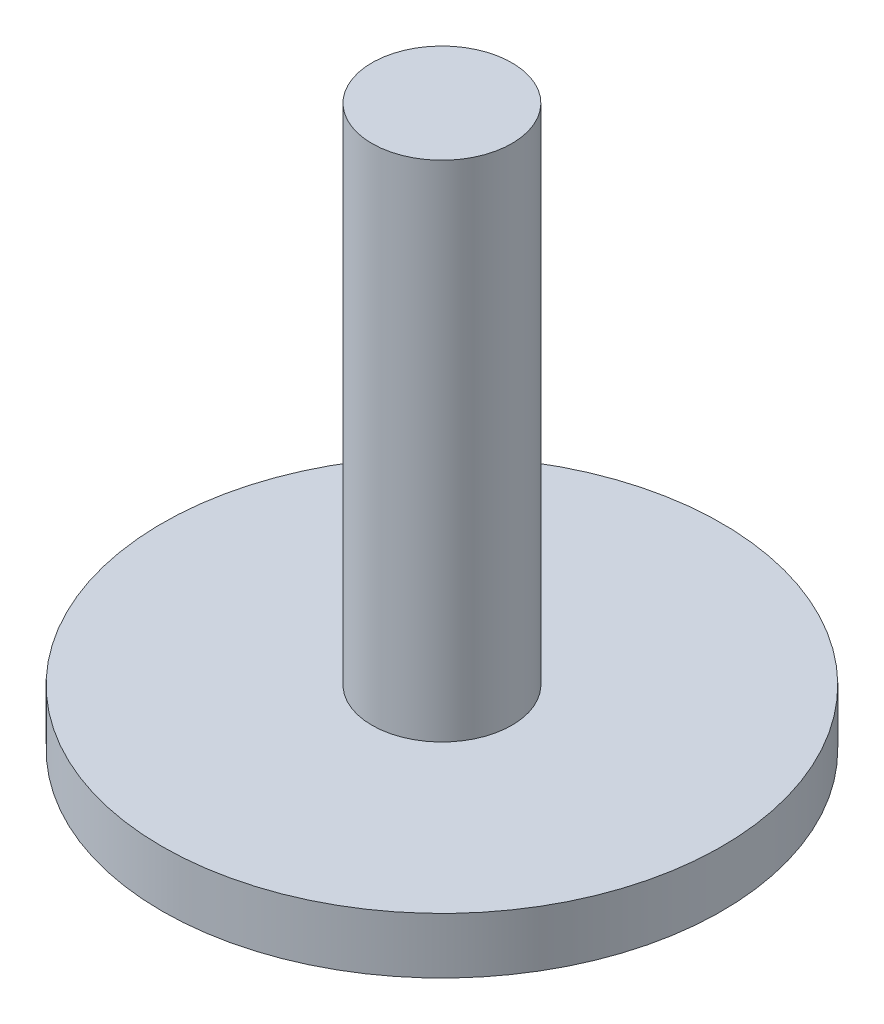
ISO-10303-21;
HEADER;
FILE_DESCRIPTION(('STEP AP214'),'2;1');
FILE_NAME('part.step','',(''),(''),'','','');
FILE_SCHEMA(('AUTOMOTIVE_DESIGN { 1 0 10303 214 1 1 1 1 }'));
ENDSEC;
DATA;
#1=APPLICATION_CONTEXT('core data for automotive mechanical design processes');
#2=APPLICATION_PROTOCOL_DEFINITION('international standard','automotive_design',2000,#1);
#3=PRODUCT_CONTEXT('',#1,'mechanical');
#4=PRODUCT('Part','Part','',(#3));
#5=PRODUCT_RELATED_PRODUCT_CATEGORY('part','',(#4));
#6=PRODUCT_DEFINITION_FORMATION('','',#4);
#7=PRODUCT_DEFINITION_CONTEXT('part definition',#1,'design');
#8=PRODUCT_DEFINITION('design','',#6,#7);
#9=PRODUCT_DEFINITION_SHAPE('','',#8);
#10=(LENGTH_UNIT() NAMED_UNIT(*) SI_UNIT(.MILLI.,.METRE.));
#11=(NAMED_UNIT(*) PLANE_ANGLE_UNIT() SI_UNIT($,.RADIAN.));
#12=(NAMED_UNIT(*) SI_UNIT($,.STERADIAN.) SOLID_ANGLE_UNIT());
#13=UNCERTAINTY_MEASURE_WITH_UNIT(LENGTH_MEASURE(1.E-05),#10,'distance_accuracy_value','');
#14=(GEOMETRIC_REPRESENTATION_CONTEXT(3) GLOBAL_UNCERTAINTY_ASSIGNED_CONTEXT((#13)) GLOBAL_UNIT_ASSIGNED_CONTEXT((#10,
#11,#12)) REPRESENTATION_CONTEXT('',''));
#15=CARTESIAN_POINT('',(0.,0.,0.));
#16=DIRECTION('',(0.,0.,1.));
#17=DIRECTION('',(1.,0.,0.));
#18=AXIS2_PLACEMENT_3D('',#15,#16,#17);
#19=CARTESIAN_POINT('',(0.,5.08,0.));
#20=DIRECTION('',(0.,-1.,0.));
#21=DIRECTION('',(0.,0.,-1.));
#22=AXIS2_PLACEMENT_3D('',#19,#20,#21);
#23=CYLINDRICAL_SURFACE('',#22,0.635);
#24=CARTESIAN_POINT('',(0.,0.508,0.));
#25=DIRECTION('',(0.,1.,0.));
#26=DIRECTION('',(0.,0.,1.));
#27=AXIS2_PLACEMENT_3D('',#24,#25,#26);
#28=CIRCLE('',#27,0.635);
#29=CARTESIAN_POINT('',(0.,0.508,0.635));
#30=VERTEX_POINT('',#29);
#31=EDGE_CURVE('E33',#30,#30,#28,.T.);
#32=ORIENTED_EDGE('',*,*,#31,.T.);
#33=EDGE_LOOP('',(#32));
#34=FACE_BOUND('',#33,.T.);
#35=CARTESIAN_POINT('',(0.,5.08,0.));
#36=DIRECTION('',(0.,1.,0.));
#37=DIRECTION('',(0.,0.,1.));
#38=AXIS2_PLACEMENT_3D('',#35,#36,#37);
#39=CIRCLE('',#38,0.635);
#40=CARTESIAN_POINT('',(0.,5.08,0.635));
#41=VERTEX_POINT('',#40);
#42=EDGE_CURVE('E10',#41,#41,#39,.T.);
#43=ORIENTED_EDGE('',*,*,#42,.F.);
#44=EDGE_LOOP('',(#43));
#45=FACE_BOUND('',#44,.T.);
#46=ADVANCED_FACE('F30',(#34,#45),#23,.T.);
#47=CARTESIAN_POINT('',(0.,5.08,0.));
#48=DIRECTION('',(0.,1.,0.));
#49=DIRECTION('',(0.,0.,1.));
#50=AXIS2_PLACEMENT_3D('',#47,#48,#49);
#51=PLANE('',#50);
#52=ORIENTED_EDGE('',*,*,#42,.T.);
#53=EDGE_LOOP('',(#52));
#54=FACE_BOUND('',#53,.T.);
#55=ADVANCED_FACE('F63',(#54),#51,.T.);
#56=CARTESIAN_POINT('',(0.,0.508,0.));
#57=DIRECTION('',(0.,1.,0.));
#58=DIRECTION('',(0.,0.,1.));
#59=AXIS2_PLACEMENT_3D('',#56,#57,#58);
#60=PLANE('',#59);
#61=CARTESIAN_POINT('',(0.,0.508,0.));
#62=DIRECTION('',(0.,1.,0.));
#63=DIRECTION('',(0.,0.,1.));
#64=AXIS2_PLACEMENT_3D('',#61,#62,#63);
#65=CIRCLE('',#64,2.54);
#66=CARTESIAN_POINT('',(0.,0.508,2.54));
#67=VERTEX_POINT('',#66);
#68=EDGE_CURVE('E40',#67,#67,#65,.T.);
#69=ORIENTED_EDGE('',*,*,#68,.T.);
#70=EDGE_LOOP('',(#69));
#71=FACE_BOUND('',#70,.T.);
#72=ORIENTED_EDGE('',*,*,#31,.F.);
#73=EDGE_LOOP('',(#72));
#74=FACE_BOUND('',#73,.T.);
#75=ADVANCED_FACE('F48',(#71,#74),#60,.T.);
#76=CARTESIAN_POINT('',(0.,0.508,0.));
#77=DIRECTION('',(0.,-1.,0.));
#78=DIRECTION('',(0.,0.,-1.));
#79=AXIS2_PLACEMENT_3D('',#76,#77,#78);
#80=CYLINDRICAL_SURFACE('',#79,2.54);
#81=ORIENTED_EDGE('',*,*,#68,.F.);
#82=EDGE_LOOP('',(#81));
#83=FACE_BOUND('',#82,.T.);
#84=CARTESIAN_POINT('',(0.,0.,0.));
#85=DIRECTION('',(0.,1.,0.));
#86=DIRECTION('',(0.,0.,1.));
#87=AXIS2_PLACEMENT_3D('',#84,#85,#86);
#88=CIRCLE('',#87,2.54);
#89=CARTESIAN_POINT('',(0.,0.,2.54));
#90=VERTEX_POINT('',#89);
#91=EDGE_CURVE('E42',#90,#90,#88,.T.);
#92=ORIENTED_EDGE('',*,*,#91,.T.);
#93=EDGE_LOOP('',(#92));
#94=FACE_BOUND('',#93,.T.);
#95=ADVANCED_FACE('F51',(#83,#94),#80,.T.);
#96=CARTESIAN_POINT('',(0.,0.,0.));
#97=DIRECTION('',(0.,1.,0.));
#98=DIRECTION('',(0.,0.,1.));
#99=AXIS2_PLACEMENT_3D('',#96,#97,#98);
#100=PLANE('',#99);
#101=ORIENTED_EDGE('',*,*,#91,.F.);
#102=EDGE_LOOP('',(#101));
#103=FACE_BOUND('',#102,.T.);
#104=ADVANCED_FACE('F54',(#103),#100,.F.);
#105=CLOSED_SHELL('',(#46,#55,#75,#95,#104));
#106=MANIFOLD_SOLID_BREP('B2',#105);
#107=ADVANCED_BREP_SHAPE_REPRESENTATION('',(#18,#106),#14);
#108=SHAPE_DEFINITION_REPRESENTATION(#9,#107);
ENDSEC;
END-ISO-10303-21;
